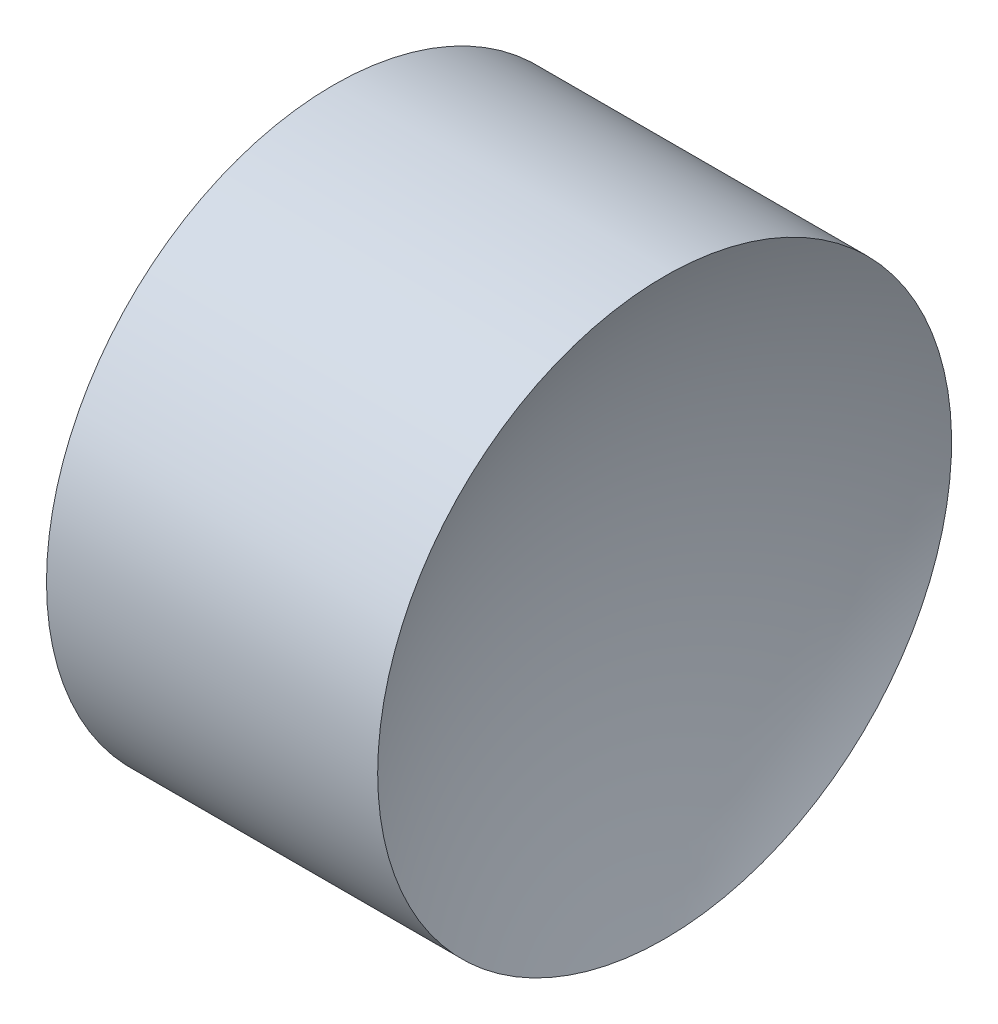
ISO-10303-21;
HEADER;
FILE_DESCRIPTION(('STEP AP214'),'2;1');
FILE_NAME('part.step','',(''),(''),'','','');
FILE_SCHEMA(('AUTOMOTIVE_DESIGN { 1 0 10303 214 1 1 1 1 }'));
ENDSEC;
DATA;
#1=APPLICATION_CONTEXT('core data for automotive mechanical design processes');
#2=APPLICATION_PROTOCOL_DEFINITION('international standard','automotive_design',2000,#1);
#3=PRODUCT_CONTEXT('',#1,'mechanical');
#4=PRODUCT('Part','Part','',(#3));
#5=PRODUCT_RELATED_PRODUCT_CATEGORY('part','',(#4));
#6=PRODUCT_DEFINITION_FORMATION('','',#4);
#7=PRODUCT_DEFINITION_CONTEXT('part definition',#1,'design');
#8=PRODUCT_DEFINITION('design','',#6,#7);
#9=PRODUCT_DEFINITION_SHAPE('','',#8);
#10=(LENGTH_UNIT() NAMED_UNIT(*) SI_UNIT(.MILLI.,.METRE.));
#11=(NAMED_UNIT(*) PLANE_ANGLE_UNIT() SI_UNIT($,.RADIAN.));
#12=(NAMED_UNIT(*) SI_UNIT($,.STERADIAN.) SOLID_ANGLE_UNIT());
#13=UNCERTAINTY_MEASURE_WITH_UNIT(LENGTH_MEASURE(1.E-05),#10,'distance_accuracy_value','');
#14=(GEOMETRIC_REPRESENTATION_CONTEXT(3) GLOBAL_UNCERTAINTY_ASSIGNED_CONTEXT((#13)) GLOBAL_UNIT_ASSIGNED_CONTEXT((#10,
#11,#12)) REPRESENTATION_CONTEXT('',''));
#15=CARTESIAN_POINT('',(0.,0.,0.));
#16=DIRECTION('',(0.,0.,1.));
#17=DIRECTION('',(1.,0.,0.));
#18=AXIS2_PLACEMENT_3D('',#15,#16,#17);
#19=CARTESIAN_POINT('',(8.25411860363702,6.52226028729874,0.));
#20=DIRECTION('',(-1.,0.,0.));
#21=DIRECTION('',(0.,1.,0.));
#22=AXIS2_PLACEMENT_3D('',#19,#20,#21);
#23=SPHERICAL_SURFACE('',#22,3.26);
#24=CARTESIAN_POINT('',(11.1485270060571,6.52226028729874,0.));
#25=DIRECTION('',(-1.,0.,0.));
#26=DIRECTION('',(0.,0.,1.));
#27=AXIS2_PLACEMENT_3D('',#24,#25,#26);
#28=CIRCLE('',#27,1.5);
#29=CARTESIAN_POINT('',(11.1485270060571,6.52226028729874,1.5));
#30=VERTEX_POINT('',#29);
#31=EDGE_CURVE('E41',#30,#30,#28,.T.);
#32=ORIENTED_EDGE('',*,*,#31,.T.);
#33=EDGE_LOOP('',(#32));
#34=FACE_BOUND('',#33,.T.);
#35=ADVANCED_FACE('F35',(#34),#23,.F.);
#36=CARTESIAN_POINT('',(15.774118603637,6.52226028729874,0.));
#37=DIRECTION('',(-1.,0.,0.));
#38=DIRECTION('',(0.,-1.,0.));
#39=AXIS2_PLACEMENT_3D('',#36,#37,#38);
#40=SPHERICAL_SURFACE('',#39,3.26);
#41=CARTESIAN_POINT('',(12.8797102012169,6.52226028729874,0.));
#42=DIRECTION('',(-1.,0.,0.));
#43=DIRECTION('',(0.,0.,1.));
#44=AXIS2_PLACEMENT_3D('',#41,#42,#43);
#45=CIRCLE('',#44,1.5);
#46=CARTESIAN_POINT('',(12.8797102012169,6.52226028729874,1.5));
#47=VERTEX_POINT('',#46);
#48=EDGE_CURVE('E10',#47,#47,#45,.T.);
#49=ORIENTED_EDGE('',*,*,#48,.F.);
#50=EDGE_LOOP('',(#49));
#51=FACE_BOUND('',#50,.T.);
#52=ADVANCED_FACE('F50',(#51),#40,.F.);
#53=CARTESIAN_POINT('',(10.6124652785342,6.52226028729874,0.));
#54=DIRECTION('',(-1.,0.,0.));
#55=DIRECTION('',(0.,0.,1.));
#56=AXIS2_PLACEMENT_3D('',#53,#54,#55);
#57=CYLINDRICAL_SURFACE('',#56,1.5);
#58=ORIENTED_EDGE('',*,*,#31,.F.);
#59=EDGE_LOOP('',(#58));
#60=FACE_BOUND('',#59,.T.);
#61=ORIENTED_EDGE('',*,*,#48,.T.);
#62=EDGE_LOOP('',(#61));
#63=FACE_BOUND('',#62,.T.);
#64=ADVANCED_FACE('F48',(#60,#63),#57,.T.);
#65=CLOSED_SHELL('',(#35,#52,#64));
#66=MANIFOLD_SOLID_BREP('B2',#65);
#67=ADVANCED_BREP_SHAPE_REPRESENTATION('',(#18,#66),#14);
#68=SHAPE_DEFINITION_REPRESENTATION(#9,#67);
ENDSEC;
END-ISO-10303-21;
